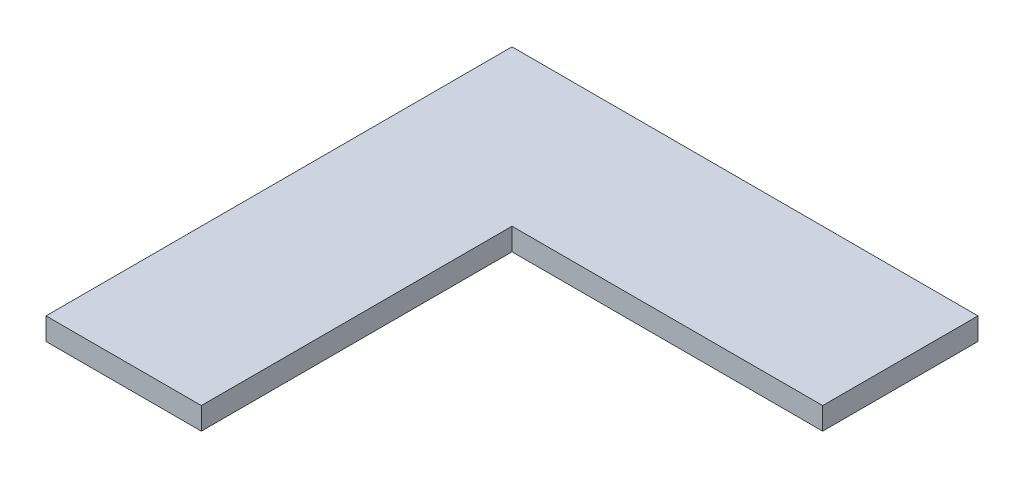
ISO-10303-21;
HEADER;
FILE_DESCRIPTION(('STEP AP214'),'2;1');
FILE_NAME('part.step','',(''),(''),'','','');
FILE_SCHEMA(('AUTOMOTIVE_DESIGN { 1 0 10303 214 1 1 1 1 }'));
ENDSEC;
DATA;
#1=APPLICATION_CONTEXT('core data for automotive mechanical design processes');
#2=APPLICATION_PROTOCOL_DEFINITION('international standard','automotive_design',2000,#1);
#3=PRODUCT_CONTEXT('',#1,'mechanical');
#4=PRODUCT('Part','Part','',(#3));
#5=PRODUCT_RELATED_PRODUCT_CATEGORY('part','',(#4));
#6=PRODUCT_DEFINITION_FORMATION('','',#4);
#7=PRODUCT_DEFINITION_CONTEXT('part definition',#1,'design');
#8=PRODUCT_DEFINITION('design','',#6,#7);
#9=PRODUCT_DEFINITION_SHAPE('','',#8);
#10=(LENGTH_UNIT() NAMED_UNIT(*) SI_UNIT(.MILLI.,.METRE.));
#11=(NAMED_UNIT(*) PLANE_ANGLE_UNIT() SI_UNIT($,.RADIAN.));
#12=(NAMED_UNIT(*) SI_UNIT($,.STERADIAN.) SOLID_ANGLE_UNIT());
#13=UNCERTAINTY_MEASURE_WITH_UNIT(LENGTH_MEASURE(1.E-05),#10,'distance_accuracy_value','');
#14=(GEOMETRIC_REPRESENTATION_CONTEXT(3) GLOBAL_UNCERTAINTY_ASSIGNED_CONTEXT((#13)) GLOBAL_UNIT_ASSIGNED_CONTEXT((#10,
#11,#12)) REPRESENTATION_CONTEXT('',''));
#15=CARTESIAN_POINT('',(0.,0.,0.));
#16=DIRECTION('',(0.,0.,1.));
#17=DIRECTION('',(1.,0.,0.));
#18=AXIS2_PLACEMENT_3D('',#15,#16,#17);
#19=CARTESIAN_POINT('',(-105.,10.,-105.));
#20=DIRECTION('',(0.,0.,1.));
#21=DIRECTION('',(1.,0.,0.));
#22=AXIS2_PLACEMENT_3D('',#19,#20,#21);
#23=PLANE('',#22);
#24=DIRECTION('',(-1.,0.,0.));
#25=VECTOR('',#24,1.);
#26=CARTESIAN_POINT('',(-105.,0.,-105.));
#27=LINE('',#26,#25);
#28=CARTESIAN_POINT('',(105.,0.,-105.));
#29=VERTEX_POINT('',#28);
#30=CARTESIAN_POINT('',(-105.,0.,-105.));
#31=VERTEX_POINT('',#30);
#32=EDGE_CURVE('E118',#29,#31,#27,.T.);
#33=ORIENTED_EDGE('',*,*,#32,.T.);
#34=DIRECTION('',(0.,-1.,0.));
#35=VECTOR('',#34,1.);
#36=CARTESIAN_POINT('',(-105.,10.,-105.));
#37=LINE('',#36,#35);
#38=CARTESIAN_POINT('',(-105.,10.,-105.));
#39=VERTEX_POINT('',#38);
#40=EDGE_CURVE('E11',#39,#31,#37,.T.);
#41=ORIENTED_EDGE('',*,*,#40,.F.);
#42=DIRECTION('',(-1.,0.,0.));
#43=VECTOR('',#42,1.);
#44=CARTESIAN_POINT('',(-105.,10.,-105.));
#45=LINE('',#44,#43);
#46=CARTESIAN_POINT('',(105.,10.,-105.));
#47=VERTEX_POINT('',#46);
#48=EDGE_CURVE('E128',#47,#39,#45,.T.);
#49=ORIENTED_EDGE('',*,*,#48,.F.);
#50=DIRECTION('',(0.,-1.,0.));
#51=VECTOR('',#50,1.);
#52=CARTESIAN_POINT('',(105.,10.,-105.));
#53=LINE('',#52,#51);
#54=EDGE_CURVE('E114',#47,#29,#53,.T.);
#55=ORIENTED_EDGE('',*,*,#54,.T.);
#56=EDGE_LOOP('',(#33,#41,#49,#55));
#57=FACE_BOUND('',#56,.T.);
#58=ADVANCED_FACE('F34',(#57),#23,.F.);
#59=CARTESIAN_POINT('',(-105.,10.,105.));
#60=DIRECTION('',(1.,0.,0.));
#61=DIRECTION('',(0.,0.,-1.));
#62=AXIS2_PLACEMENT_3D('',#59,#60,#61);
#63=PLANE('',#62);
#64=DIRECTION('',(0.,0.,1.));
#65=VECTOR('',#64,1.);
#66=CARTESIAN_POINT('',(-105.,0.,105.));
#67=LINE('',#66,#65);
#68=CARTESIAN_POINT('',(-105.,0.,105.));
#69=VERTEX_POINT('',#68);
#70=EDGE_CURVE('E121',#31,#69,#67,.T.);
#71=ORIENTED_EDGE('',*,*,#70,.T.);
#72=DIRECTION('',(0.,-1.,0.));
#73=VECTOR('',#72,1.);
#74=CARTESIAN_POINT('',(-105.,10.,105.));
#75=LINE('',#74,#73);
#76=CARTESIAN_POINT('',(-105.,10.,105.));
#77=VERTEX_POINT('',#76);
#78=EDGE_CURVE('E42',#77,#69,#75,.T.);
#79=ORIENTED_EDGE('',*,*,#78,.F.);
#80=DIRECTION('',(0.,0.,1.));
#81=VECTOR('',#80,1.);
#82=CARTESIAN_POINT('',(-105.,10.,105.));
#83=LINE('',#82,#81);
#84=EDGE_CURVE('E87',#39,#77,#83,.T.);
#85=ORIENTED_EDGE('',*,*,#84,.F.);
#86=ORIENTED_EDGE('',*,*,#40,.T.);
#87=EDGE_LOOP('',(#71,#79,#85,#86));
#88=FACE_BOUND('',#87,.T.);
#89=ADVANCED_FACE('F152',(#88),#63,.F.);
#90=CARTESIAN_POINT('',(-35.,10.,105.));
#91=DIRECTION('',(0.,0.,-1.));
#92=DIRECTION('',(-1.,0.,0.));
#93=AXIS2_PLACEMENT_3D('',#90,#91,#92);
#94=PLANE('',#93);
#95=DIRECTION('',(1.,0.,0.));
#96=VECTOR('',#95,1.);
#97=CARTESIAN_POINT('',(-35.,0.,105.));
#98=LINE('',#97,#96);
#99=CARTESIAN_POINT('',(-35.,0.,105.));
#100=VERTEX_POINT('',#99);
#101=EDGE_CURVE('E123',#69,#100,#98,.T.);
#102=ORIENTED_EDGE('',*,*,#101,.T.);
#103=DIRECTION('',(0.,-1.,0.));
#104=VECTOR('',#103,1.);
#105=CARTESIAN_POINT('',(-35.,10.,105.));
#106=LINE('',#105,#104);
#107=CARTESIAN_POINT('',(-35.,10.,105.));
#108=VERTEX_POINT('',#107);
#109=EDGE_CURVE('E109',#108,#100,#106,.T.);
#110=ORIENTED_EDGE('',*,*,#109,.F.);
#111=DIRECTION('',(1.,0.,0.));
#112=VECTOR('',#111,1.);
#113=CARTESIAN_POINT('',(-35.,10.,105.));
#114=LINE('',#113,#112);
#115=EDGE_CURVE('E100',#77,#108,#114,.T.);
#116=ORIENTED_EDGE('',*,*,#115,.F.);
#117=ORIENTED_EDGE('',*,*,#78,.T.);
#118=EDGE_LOOP('',(#102,#110,#116,#117));
#119=FACE_BOUND('',#118,.T.);
#120=ADVANCED_FACE('F134',(#119),#94,.F.);
#121=CARTESIAN_POINT('',(-35.,10.,-35.));
#122=DIRECTION('',(-1.,0.,0.));
#123=DIRECTION('',(0.,0.,1.));
#124=AXIS2_PLACEMENT_3D('',#121,#122,#123);
#125=PLANE('',#124);
#126=DIRECTION('',(0.,0.,-1.));
#127=VECTOR('',#126,1.);
#128=CARTESIAN_POINT('',(-35.,0.,-35.));
#129=LINE('',#128,#127);
#130=CARTESIAN_POINT('',(-35.,0.,-35.));
#131=VERTEX_POINT('',#130);
#132=EDGE_CURVE('E108',#100,#131,#129,.T.);
#133=ORIENTED_EDGE('',*,*,#132,.T.);
#134=DIRECTION('',(0.,-1.,0.));
#135=VECTOR('',#134,1.);
#136=CARTESIAN_POINT('',(-35.,10.,-35.));
#137=LINE('',#136,#135);
#138=CARTESIAN_POINT('',(-35.,10.,-35.));
#139=VERTEX_POINT('',#138);
#140=EDGE_CURVE('E105',#139,#131,#137,.T.);
#141=ORIENTED_EDGE('',*,*,#140,.F.);
#142=DIRECTION('',(0.,0.,-1.));
#143=VECTOR('',#142,1.);
#144=CARTESIAN_POINT('',(-35.,10.,-35.));
#145=LINE('',#144,#143);
#146=EDGE_CURVE('E94',#108,#139,#145,.T.);
#147=ORIENTED_EDGE('',*,*,#146,.F.);
#148=ORIENTED_EDGE('',*,*,#109,.T.);
#149=EDGE_LOOP('',(#133,#141,#147,#148));
#150=FACE_BOUND('',#149,.T.);
#151=ADVANCED_FACE('F106',(#150),#125,.F.);
#152=CARTESIAN_POINT('',(105.,10.,-35.));
#153=DIRECTION('',(0.,0.,-1.));
#154=DIRECTION('',(-1.,0.,0.));
#155=AXIS2_PLACEMENT_3D('',#152,#153,#154);
#156=PLANE('',#155);
#157=DIRECTION('',(1.,0.,0.));
#158=VECTOR('',#157,1.);
#159=CARTESIAN_POINT('',(105.,0.,-35.));
#160=LINE('',#159,#158);
#161=CARTESIAN_POINT('',(105.,0.,-35.));
#162=VERTEX_POINT('',#161);
#163=EDGE_CURVE('E73',#131,#162,#160,.T.);
#164=ORIENTED_EDGE('',*,*,#163,.T.);
#165=DIRECTION('',(0.,-1.,0.));
#166=VECTOR('',#165,1.);
#167=CARTESIAN_POINT('',(105.,10.,-35.));
#168=LINE('',#167,#166);
#169=CARTESIAN_POINT('',(105.,10.,-35.));
#170=VERTEX_POINT('',#169);
#171=EDGE_CURVE('E110',#170,#162,#168,.T.);
#172=ORIENTED_EDGE('',*,*,#171,.F.);
#173=DIRECTION('',(1.,0.,0.));
#174=VECTOR('',#173,1.);
#175=CARTESIAN_POINT('',(105.,10.,-35.));
#176=LINE('',#175,#174);
#177=EDGE_CURVE('E98',#139,#170,#176,.T.);
#178=ORIENTED_EDGE('',*,*,#177,.F.);
#179=ORIENTED_EDGE('',*,*,#140,.T.);
#180=EDGE_LOOP('',(#164,#172,#178,#179));
#181=FACE_BOUND('',#180,.T.);
#182=ADVANCED_FACE('F112',(#181),#156,.F.);
#183=CARTESIAN_POINT('',(105.,10.,-105.));
#184=DIRECTION('',(-1.,0.,0.));
#185=DIRECTION('',(0.,0.,1.));
#186=AXIS2_PLACEMENT_3D('',#183,#184,#185);
#187=PLANE('',#186);
#188=DIRECTION('',(0.,0.,-1.));
#189=VECTOR('',#188,1.);
#190=CARTESIAN_POINT('',(105.,0.,-105.));
#191=LINE('',#190,#189);
#192=EDGE_CURVE('E79',#162,#29,#191,.T.);
#193=ORIENTED_EDGE('',*,*,#192,.T.);
#194=ORIENTED_EDGE('',*,*,#54,.F.);
#195=DIRECTION('',(0.,0.,-1.));
#196=VECTOR('',#195,1.);
#197=CARTESIAN_POINT('',(105.,10.,-105.));
#198=LINE('',#197,#196);
#199=EDGE_CURVE('E50',#170,#47,#198,.T.);
#200=ORIENTED_EDGE('',*,*,#199,.F.);
#201=ORIENTED_EDGE('',*,*,#171,.T.);
#202=EDGE_LOOP('',(#193,#194,#200,#201));
#203=FACE_BOUND('',#202,.T.);
#204=ADVANCED_FACE('F141',(#203),#187,.F.);
#205=CARTESIAN_POINT('',(0.,10.,0.));
#206=DIRECTION('',(0.,-1.,0.));
#207=DIRECTION('',(0.,0.,-1.));
#208=AXIS2_PLACEMENT_3D('',#205,#206,#207);
#209=PLANE('',#208);
#210=ORIENTED_EDGE('',*,*,#48,.T.);
#211=ORIENTED_EDGE('',*,*,#84,.T.);
#212=ORIENTED_EDGE('',*,*,#115,.T.);
#213=ORIENTED_EDGE('',*,*,#146,.T.);
#214=ORIENTED_EDGE('',*,*,#177,.T.);
#215=ORIENTED_EDGE('',*,*,#199,.T.);
#216=EDGE_LOOP('',(#210,#211,#212,#213,#214,#215));
#217=FACE_BOUND('',#216,.T.);
#218=ADVANCED_FACE('F96',(#217),#209,.F.);
#219=CARTESIAN_POINT('',(0.,0.,0.));
#220=DIRECTION('',(0.,-1.,0.));
#221=DIRECTION('',(0.,0.,-1.));
#222=AXIS2_PLACEMENT_3D('',#219,#220,#221);
#223=PLANE('',#222);
#224=ORIENTED_EDGE('',*,*,#32,.F.);
#225=ORIENTED_EDGE('',*,*,#192,.F.);
#226=ORIENTED_EDGE('',*,*,#163,.F.);
#227=ORIENTED_EDGE('',*,*,#132,.F.);
#228=ORIENTED_EDGE('',*,*,#101,.F.);
#229=ORIENTED_EDGE('',*,*,#70,.F.);
#230=EDGE_LOOP('',(#224,#225,#226,#227,#228,#229));
#231=FACE_BOUND('',#230,.T.);
#232=ADVANCED_FACE('F137',(#231),#223,.T.);
#233=CLOSED_SHELL('',(#58,#89,#120,#151,#182,#204,#218,#232));
#234=MANIFOLD_SOLID_BREP('B2',#233);
#235=ADVANCED_BREP_SHAPE_REPRESENTATION('',(#18,#234),#14);
#236=SHAPE_DEFINITION_REPRESENTATION(#9,#235);
ENDSEC;
END-ISO-10303-21;
